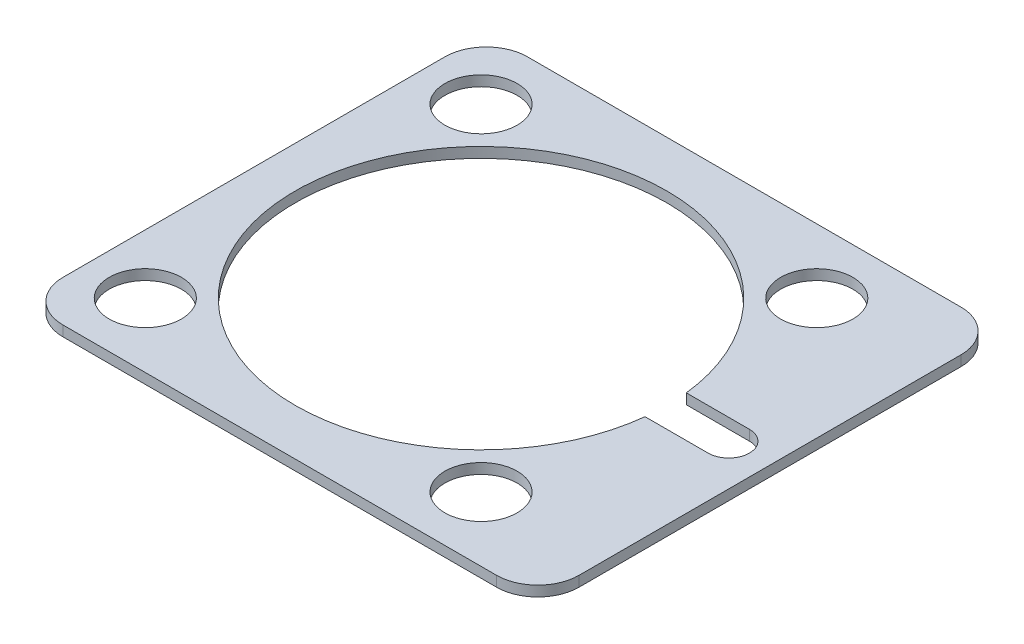
ISO-10303-21;
HEADER;
FILE_DESCRIPTION(('STEP AP214'),'2;1');
FILE_NAME('part.step','',(''),(''),'','','');
FILE_SCHEMA(('AUTOMOTIVE_DESIGN { 1 0 10303 214 1 1 1 1 }'));
ENDSEC;
DATA;
#1=APPLICATION_CONTEXT('core data for automotive mechanical design processes');
#2=APPLICATION_PROTOCOL_DEFINITION('international standard','automotive_design',2000,#1);
#3=PRODUCT_CONTEXT('',#1,'mechanical');
#4=PRODUCT('Part','Part','',(#3));
#5=PRODUCT_RELATED_PRODUCT_CATEGORY('part','',(#4));
#6=PRODUCT_DEFINITION_FORMATION('','',#4);
#7=PRODUCT_DEFINITION_CONTEXT('part definition',#1,'design');
#8=PRODUCT_DEFINITION('design','',#6,#7);
#9=PRODUCT_DEFINITION_SHAPE('','',#8);
#10=(LENGTH_UNIT() NAMED_UNIT(*) SI_UNIT(.MILLI.,.METRE.));
#11=(NAMED_UNIT(*) PLANE_ANGLE_UNIT() SI_UNIT($,.RADIAN.));
#12=(NAMED_UNIT(*) SI_UNIT($,.STERADIAN.) SOLID_ANGLE_UNIT());
#13=UNCERTAINTY_MEASURE_WITH_UNIT(LENGTH_MEASURE(1.E-05),#10,'distance_accuracy_value','');
#14=(GEOMETRIC_REPRESENTATION_CONTEXT(3) GLOBAL_UNCERTAINTY_ASSIGNED_CONTEXT((#13)) GLOBAL_UNIT_ASSIGNED_CONTEXT((#10,
#11,#12)) REPRESENTATION_CONTEXT('',''));
#15=CARTESIAN_POINT('',(0.,0.,0.));
#16=DIRECTION('',(0.,0.,1.));
#17=DIRECTION('',(1.,0.,0.));
#18=AXIS2_PLACEMENT_3D('',#15,#16,#17);
#19=CARTESIAN_POINT('',(-22.,0.5,22.5));
#20=DIRECTION('',(1.,0.,0.));
#21=DIRECTION('',(0.,0.,-1.));
#22=AXIS2_PLACEMENT_3D('',#19,#20,#21);
#23=PLANE('',#22);
#24=DIRECTION('',(0.,0.,1.));
#25=VECTOR('',#24,1.);
#26=CARTESIAN_POINT('',(-22.,0.5,22.5));
#27=LINE('',#26,#25);
#28=CARTESIAN_POINT('',(-22.,0.5,-18.5));
#29=VERTEX_POINT('',#28);
#30=CARTESIAN_POINT('',(-22.,0.5,18.5));
#31=VERTEX_POINT('',#30);
#32=EDGE_CURVE('E198',#29,#31,#27,.T.);
#33=ORIENTED_EDGE('',*,*,#32,.F.);
#34=DIRECTION('',(0.,-1.,0.));
#35=VECTOR('',#34,1.);
#36=CARTESIAN_POINT('',(-22.,0.5,-18.5));
#37=LINE('',#36,#35);
#38=CARTESIAN_POINT('',(-22.,-0.5,-18.5));
#39=VERTEX_POINT('',#38);
#40=EDGE_CURVE('E229',#29,#39,#37,.T.);
#41=ORIENTED_EDGE('',*,*,#40,.T.);
#42=DIRECTION('',(0.,0.,1.));
#43=VECTOR('',#42,1.);
#44=CARTESIAN_POINT('',(-22.,-0.5,22.5));
#45=LINE('',#44,#43);
#46=CARTESIAN_POINT('',(-22.,-0.5,18.5));
#47=VERTEX_POINT('',#46);
#48=EDGE_CURVE('E192',#39,#47,#45,.T.);
#49=ORIENTED_EDGE('',*,*,#48,.T.);
#50=DIRECTION('',(0.,-1.,0.));
#51=VECTOR('',#50,1.);
#52=CARTESIAN_POINT('',(-22.,0.5,18.5));
#53=LINE('',#52,#51);
#54=EDGE_CURVE('E213',#47,#31,#53,.F.);
#55=ORIENTED_EDGE('',*,*,#54,.T.);
#56=EDGE_LOOP('',(#33,#41,#49,#55));
#57=FACE_BOUND('',#56,.T.);
#58=ADVANCED_FACE('F45',(#57),#23,.F.);
#59=CARTESIAN_POINT('',(28.,0.5,22.5));
#60=DIRECTION('',(0.,0.,-1.));
#61=DIRECTION('',(-1.,0.,0.));
#62=AXIS2_PLACEMENT_3D('',#59,#60,#61);
#63=PLANE('',#62);
#64=DIRECTION('',(1.,0.,0.));
#65=VECTOR('',#64,1.);
#66=CARTESIAN_POINT('',(28.,0.5,22.5));
#67=LINE('',#66,#65);
#68=CARTESIAN_POINT('',(-18.,0.5,22.5));
#69=VERTEX_POINT('',#68);
#70=CARTESIAN_POINT('',(24.,0.5,22.5));
#71=VERTEX_POINT('',#70);
#72=EDGE_CURVE('E202',#69,#71,#67,.T.);
#73=ORIENTED_EDGE('',*,*,#72,.F.);
#74=DIRECTION('',(0.,-1.,0.));
#75=VECTOR('',#74,1.);
#76=CARTESIAN_POINT('',(-18.,0.5,22.5));
#77=LINE('',#76,#75);
#78=CARTESIAN_POINT('',(-18.,-0.5,22.5));
#79=VERTEX_POINT('',#78);
#80=EDGE_CURVE('E11',#69,#79,#77,.T.);
#81=ORIENTED_EDGE('',*,*,#80,.T.);
#82=DIRECTION('',(1.,0.,0.));
#83=VECTOR('',#82,1.);
#84=CARTESIAN_POINT('',(28.,-0.5,22.5));
#85=LINE('',#84,#83);
#86=CARTESIAN_POINT('',(24.,-0.5,22.5));
#87=VERTEX_POINT('',#86);
#88=EDGE_CURVE('E217',#79,#87,#85,.T.);
#89=ORIENTED_EDGE('',*,*,#88,.T.);
#90=DIRECTION('',(0.,-1.,0.));
#91=VECTOR('',#90,1.);
#92=CARTESIAN_POINT('',(24.,0.5,22.5));
#93=LINE('',#92,#91);
#94=EDGE_CURVE('E54',#87,#71,#93,.F.);
#95=ORIENTED_EDGE('',*,*,#94,.T.);
#96=EDGE_LOOP('',(#73,#81,#89,#95));
#97=FACE_BOUND('',#96,.T.);
#98=ADVANCED_FACE('F273',(#97),#63,.F.);
#99=CARTESIAN_POINT('',(28.,0.5,22.5));
#100=DIRECTION('',(-1.,0.,0.));
#101=DIRECTION('',(0.,0.,1.));
#102=AXIS2_PLACEMENT_3D('',#99,#100,#101);
#103=PLANE('',#102);
#104=DIRECTION('',(0.,0.,-1.));
#105=VECTOR('',#104,1.);
#106=CARTESIAN_POINT('',(28.,-0.5,22.5));
#107=LINE('',#106,#105);
#108=CARTESIAN_POINT('',(28.,-0.5,18.5));
#109=VERTEX_POINT('',#108);
#110=CARTESIAN_POINT('',(28.,-0.5,-18.5));
#111=VERTEX_POINT('',#110);
#112=EDGE_CURVE('E221',#109,#111,#107,.T.);
#113=ORIENTED_EDGE('',*,*,#112,.T.);
#114=DIRECTION('',(0.,-1.,0.));
#115=VECTOR('',#114,1.);
#116=CARTESIAN_POINT('',(28.,0.5,-18.5));
#117=LINE('',#116,#115);
#118=CARTESIAN_POINT('',(28.,0.5,-18.5));
#119=VERTEX_POINT('',#118);
#120=EDGE_CURVE('E61',#111,#119,#117,.F.);
#121=ORIENTED_EDGE('',*,*,#120,.T.);
#122=DIRECTION('',(0.,0.,-1.));
#123=VECTOR('',#122,1.);
#124=CARTESIAN_POINT('',(28.,0.5,22.5));
#125=LINE('',#124,#123);
#126=CARTESIAN_POINT('',(28.,0.5,18.5));
#127=VERTEX_POINT('',#126);
#128=EDGE_CURVE('E206',#127,#119,#125,.T.);
#129=ORIENTED_EDGE('',*,*,#128,.F.);
#130=DIRECTION('',(0.,-1.,0.));
#131=VECTOR('',#130,1.);
#132=CARTESIAN_POINT('',(28.,0.5,18.5));
#133=LINE('',#132,#131);
#134=EDGE_CURVE('E263',#127,#109,#133,.T.);
#135=ORIENTED_EDGE('',*,*,#134,.T.);
#136=EDGE_LOOP('',(#113,#121,#129,#135));
#137=FACE_BOUND('',#136,.T.);
#138=ADVANCED_FACE('F281',(#137),#103,.F.);
#139=CARTESIAN_POINT('',(28.,0.5,-22.5));
#140=DIRECTION('',(0.,0.,1.));
#141=DIRECTION('',(1.,0.,0.));
#142=AXIS2_PLACEMENT_3D('',#139,#140,#141);
#143=PLANE('',#142);
#144=DIRECTION('',(-1.,0.,0.));
#145=VECTOR('',#144,1.);
#146=CARTESIAN_POINT('',(28.,-0.5,-22.5));
#147=LINE('',#146,#145);
#148=CARTESIAN_POINT('',(24.,-0.5,-22.5));
#149=VERTEX_POINT('',#148);
#150=CARTESIAN_POINT('',(-18.,-0.5,-22.5));
#151=VERTEX_POINT('',#150);
#152=EDGE_CURVE('E203',#149,#151,#147,.T.);
#153=ORIENTED_EDGE('',*,*,#152,.T.);
#154=DIRECTION('',(0.,-1.,0.));
#155=VECTOR('',#154,1.);
#156=CARTESIAN_POINT('',(-18.,0.5,-22.5));
#157=LINE('',#156,#155);
#158=CARTESIAN_POINT('',(-18.,0.5,-22.5));
#159=VERTEX_POINT('',#158);
#160=EDGE_CURVE('E249',#151,#159,#157,.F.);
#161=ORIENTED_EDGE('',*,*,#160,.T.);
#162=DIRECTION('',(-1.,0.,0.));
#163=VECTOR('',#162,1.);
#164=CARTESIAN_POINT('',(28.,0.5,-22.5));
#165=LINE('',#164,#163);
#166=CARTESIAN_POINT('',(24.,0.5,-22.5));
#167=VERTEX_POINT('',#166);
#168=EDGE_CURVE('E209',#167,#159,#165,.T.);
#169=ORIENTED_EDGE('',*,*,#168,.F.);
#170=DIRECTION('',(0.,-1.,0.));
#171=VECTOR('',#170,1.);
#172=CARTESIAN_POINT('',(24.,0.5,-22.5));
#173=LINE('',#172,#171);
#174=EDGE_CURVE('E245',#167,#149,#173,.T.);
#175=ORIENTED_EDGE('',*,*,#174,.T.);
#176=EDGE_LOOP('',(#153,#161,#169,#175));
#177=FACE_BOUND('',#176,.T.);
#178=ADVANCED_FACE('F290',(#177),#143,.F.);
#179=CARTESIAN_POINT('',(0.,0.5,0.));
#180=DIRECTION('',(0.,1.,0.));
#181=DIRECTION('',(0.,0.,1.));
#182=AXIS2_PLACEMENT_3D('',#179,#180,#181);
#183=PLANE('',#182);
#184=CARTESIAN_POINT('',(-16.2634559672906,0.5,-16.2634559672906));
#185=DIRECTION('',(0.,1.,0.));
#186=DIRECTION('',(1.,0.,0.));
#187=AXIS2_PLACEMENT_3D('',#184,#185,#186);
#188=CIRCLE('',#187,3.5);
#189=CARTESIAN_POINT('',(-12.7634559672906,0.5,-16.2634559672906));
#190=VERTEX_POINT('',#189);
#191=EDGE_CURVE('E489',#190,#190,#188,.T.);
#192=ORIENTED_EDGE('',*,*,#191,.F.);
#193=EDGE_LOOP('',(#192));
#194=FACE_BOUND('',#193,.T.);
#195=CARTESIAN_POINT('',(-16.2634559672906,0.5,16.2634559672906));
#196=DIRECTION('',(0.,1.,0.));
#197=DIRECTION('',(0.,0.,-1.));
#198=AXIS2_PLACEMENT_3D('',#195,#196,#197);
#199=CIRCLE('',#198,3.5);
#200=CARTESIAN_POINT('',(-16.2634559672906,0.5,12.7634559672906));
#201=VERTEX_POINT('',#200);
#202=EDGE_CURVE('E483',#201,#201,#199,.T.);
#203=ORIENTED_EDGE('',*,*,#202,.F.);
#204=EDGE_LOOP('',(#203));
#205=FACE_BOUND('',#204,.T.);
#206=CARTESIAN_POINT('',(16.2634559672907,0.5,16.2634559672904));
#207=DIRECTION('',(0.,1.,0.));
#208=DIRECTION('',(-1.,0.,0.));
#209=AXIS2_PLACEMENT_3D('',#206,#207,#208);
#210=CIRCLE('',#209,3.5);
#211=CARTESIAN_POINT('',(12.7634559672907,0.5,16.2634559672905));
#212=VERTEX_POINT('',#211);
#213=EDGE_CURVE('E477',#212,#212,#210,.T.);
#214=ORIENTED_EDGE('',*,*,#213,.F.);
#215=EDGE_LOOP('',(#214));
#216=FACE_BOUND('',#215,.T.);
#217=CARTESIAN_POINT('',(16.2634559672906,0.5,-16.2634559672906));
#218=DIRECTION('',(0.,1.,0.));
#219=DIRECTION('',(0.,0.,1.));
#220=AXIS2_PLACEMENT_3D('',#217,#218,#219);
#221=CIRCLE('',#220,3.5);
#222=CARTESIAN_POINT('',(16.2634559672906,0.5,-12.7634559672906));
#223=VERTEX_POINT('',#222);
#224=EDGE_CURVE('E173',#223,#223,#221,.T.);
#225=ORIENTED_EDGE('',*,*,#224,.F.);
#226=EDGE_LOOP('',(#225));
#227=FACE_BOUND('',#226,.T.);
#228=CARTESIAN_POINT('',(0.,0.5,0.));
#229=DIRECTION('',(0.,1.,0.));
#230=DIRECTION('',(0.,0.,1.));
#231=AXIS2_PLACEMENT_3D('',#228,#229,#230);
#232=CIRCLE('',#231,18.);
#233=CARTESIAN_POINT('',(17.8885438199983,0.5,-2.));
#234=VERTEX_POINT('',#233);
#235=CARTESIAN_POINT('',(17.8885438199983,0.5,2.));
#236=VERTEX_POINT('',#235);
#237=EDGE_CURVE('E144',#234,#236,#232,.T.);
#238=ORIENTED_EDGE('',*,*,#237,.F.);
#239=DIRECTION('',(-1.,0.,0.));
#240=VECTOR('',#239,1.);
#241=CARTESIAN_POINT('',(17.8885438199983,0.5,-2.));
#242=LINE('',#241,#240);
#243=CARTESIAN_POINT('',(24.,0.5,-2.));
#244=VERTEX_POINT('',#243);
#245=EDGE_CURVE('E165',#244,#234,#242,.T.);
#246=ORIENTED_EDGE('',*,*,#245,.F.);
#247=CARTESIAN_POINT('',(24.,0.5,0.));
#248=DIRECTION('',(0.,1.,0.));
#249=DIRECTION('',(0.,0.,1.));
#250=AXIS2_PLACEMENT_3D('',#247,#248,#249);
#251=CIRCLE('',#250,2.);
#252=CARTESIAN_POINT('',(24.,0.5,2.));
#253=VERTEX_POINT('',#252);
#254=EDGE_CURVE('E170',#253,#244,#251,.T.);
#255=ORIENTED_EDGE('',*,*,#254,.F.);
#256=DIRECTION('',(1.,0.,0.));
#257=VECTOR('',#256,1.);
#258=CARTESIAN_POINT('',(17.8885438199983,0.5,2.));
#259=LINE('',#258,#257);
#260=EDGE_CURVE('E182',#236,#253,#259,.T.);
#261=ORIENTED_EDGE('',*,*,#260,.F.);
#262=EDGE_LOOP('',(#238,#246,#255,#261));
#263=FACE_BOUND('',#262,.T.);
#264=ORIENTED_EDGE('',*,*,#168,.T.);
#265=CARTESIAN_POINT('',(-18.,0.5,-18.5));
#266=DIRECTION('',(0.,1.,0.));
#267=DIRECTION('',(0.,0.,1.));
#268=AXIS2_PLACEMENT_3D('',#265,#266,#267);
#269=CIRCLE('',#268,4.);
#270=EDGE_CURVE('E260',#159,#29,#269,.T.);
#271=ORIENTED_EDGE('',*,*,#270,.T.);
#272=ORIENTED_EDGE('',*,*,#32,.T.);
#273=CARTESIAN_POINT('',(-18.,0.5,18.5));
#274=DIRECTION('',(0.,1.,0.));
#275=DIRECTION('',(0.,0.,1.));
#276=AXIS2_PLACEMENT_3D('',#273,#274,#275);
#277=CIRCLE('',#276,4.);
#278=EDGE_CURVE('E254',#31,#69,#277,.T.);
#279=ORIENTED_EDGE('',*,*,#278,.T.);
#280=ORIENTED_EDGE('',*,*,#72,.T.);
#281=CARTESIAN_POINT('',(24.,0.5,18.5));
#282=DIRECTION('',(0.,1.,0.));
#283=DIRECTION('',(0.,0.,1.));
#284=AXIS2_PLACEMENT_3D('',#281,#282,#283);
#285=CIRCLE('',#284,4.);
#286=EDGE_CURVE('E68',#71,#127,#285,.T.);
#287=ORIENTED_EDGE('',*,*,#286,.T.);
#288=ORIENTED_EDGE('',*,*,#128,.T.);
#289=CARTESIAN_POINT('',(24.,0.5,-18.5));
#290=DIRECTION('',(0.,1.,0.));
#291=DIRECTION('',(0.,0.,1.));
#292=AXIS2_PLACEMENT_3D('',#289,#290,#291);
#293=CIRCLE('',#292,4.);
#294=EDGE_CURVE('E257',#119,#167,#293,.T.);
#295=ORIENTED_EDGE('',*,*,#294,.T.);
#296=EDGE_LOOP('',(#264,#271,#272,#279,#280,#287,#288,#295));
#297=FACE_BOUND('',#296,.T.);
#298=ADVANCED_FACE('F277',(#194,#205,#216,#227,#263,#297),#183,.T.);
#299=CARTESIAN_POINT('',(0.,-0.5,0.));
#300=DIRECTION('',(0.,1.,0.));
#301=DIRECTION('',(0.,0.,1.));
#302=AXIS2_PLACEMENT_3D('',#299,#300,#301);
#303=PLANE('',#302);
#304=CARTESIAN_POINT('',(-16.2634559672906,-0.5,-16.2634559672906));
#305=DIRECTION('',(0.,1.,0.));
#306=DIRECTION('',(1.,0.,0.));
#307=AXIS2_PLACEMENT_3D('',#304,#305,#306);
#308=CIRCLE('',#307,3.5);
#309=CARTESIAN_POINT('',(-12.7634559672906,-0.5,-16.2634559672906));
#310=VERTEX_POINT('',#309);
#311=EDGE_CURVE('E461',#310,#310,#308,.T.);
#312=ORIENTED_EDGE('',*,*,#311,.T.);
#313=EDGE_LOOP('',(#312));
#314=FACE_BOUND('',#313,.T.);
#315=CARTESIAN_POINT('',(-16.2634559672906,-0.5,16.2634559672906));
#316=DIRECTION('',(0.,1.,0.));
#317=DIRECTION('',(0.,0.,-1.));
#318=AXIS2_PLACEMENT_3D('',#315,#316,#317);
#319=CIRCLE('',#318,3.5);
#320=CARTESIAN_POINT('',(-16.2634559672906,-0.5,12.7634559672906));
#321=VERTEX_POINT('',#320);
#322=EDGE_CURVE('E465',#321,#321,#319,.T.);
#323=ORIENTED_EDGE('',*,*,#322,.T.);
#324=EDGE_LOOP('',(#323));
#325=FACE_BOUND('',#324,.T.);
#326=CARTESIAN_POINT('',(16.2634559672907,-0.5,16.2634559672904));
#327=DIRECTION('',(0.,1.,0.));
#328=DIRECTION('',(-1.,0.,0.));
#329=AXIS2_PLACEMENT_3D('',#326,#327,#328);
#330=CIRCLE('',#329,3.5);
#331=CARTESIAN_POINT('',(12.7634559672907,-0.5,16.2634559672905));
#332=VERTEX_POINT('',#331);
#333=EDGE_CURVE('E469',#332,#332,#330,.T.);
#334=ORIENTED_EDGE('',*,*,#333,.T.);
#335=EDGE_LOOP('',(#334));
#336=FACE_BOUND('',#335,.T.);
#337=CARTESIAN_POINT('',(16.2634559672906,-0.5,-16.2634559672906));
#338=DIRECTION('',(0.,1.,0.));
#339=DIRECTION('',(0.,0.,1.));
#340=AXIS2_PLACEMENT_3D('',#337,#338,#339);
#341=CIRCLE('',#340,3.5);
#342=CARTESIAN_POINT('',(16.2634559672906,-0.5,-12.7634559672906));
#343=VERTEX_POINT('',#342);
#344=EDGE_CURVE('E183',#343,#343,#341,.T.);
#345=ORIENTED_EDGE('',*,*,#344,.T.);
#346=EDGE_LOOP('',(#345));
#347=FACE_BOUND('',#346,.T.);
#348=DIRECTION('',(-1.,0.,0.));
#349=VECTOR('',#348,1.);
#350=CARTESIAN_POINT('',(17.8885438199983,-0.5,-2.));
#351=LINE('',#350,#349);
#352=CARTESIAN_POINT('',(24.,-0.5,-2.));
#353=VERTEX_POINT('',#352);
#354=CARTESIAN_POINT('',(17.8885438199983,-0.5,-2.));
#355=VERTEX_POINT('',#354);
#356=EDGE_CURVE('E150',#353,#355,#351,.T.);
#357=ORIENTED_EDGE('',*,*,#356,.T.);
#358=CARTESIAN_POINT('',(0.,-0.5,0.));
#359=DIRECTION('',(0.,1.,0.));
#360=DIRECTION('',(0.,0.,1.));
#361=AXIS2_PLACEMENT_3D('',#358,#359,#360);
#362=CIRCLE('',#361,18.);
#363=CARTESIAN_POINT('',(17.8885438199983,-0.5,2.));
#364=VERTEX_POINT('',#363);
#365=EDGE_CURVE('E141',#355,#364,#362,.T.);
#366=ORIENTED_EDGE('',*,*,#365,.T.);
#367=DIRECTION('',(1.,0.,0.));
#368=VECTOR('',#367,1.);
#369=CARTESIAN_POINT('',(17.8885438199983,-0.5,2.));
#370=LINE('',#369,#368);
#371=CARTESIAN_POINT('',(24.,-0.5,2.));
#372=VERTEX_POINT('',#371);
#373=EDGE_CURVE('E154',#364,#372,#370,.T.);
#374=ORIENTED_EDGE('',*,*,#373,.T.);
#375=CARTESIAN_POINT('',(24.,-0.5,0.));
#376=DIRECTION('',(0.,1.,0.));
#377=DIRECTION('',(0.,0.,1.));
#378=AXIS2_PLACEMENT_3D('',#375,#376,#377);
#379=CIRCLE('',#378,2.);
#380=EDGE_CURVE('E159',#372,#353,#379,.T.);
#381=ORIENTED_EDGE('',*,*,#380,.T.);
#382=EDGE_LOOP('',(#357,#366,#374,#381));
#383=FACE_BOUND('',#382,.T.);
#384=ORIENTED_EDGE('',*,*,#48,.F.);
#385=CARTESIAN_POINT('',(-18.,-0.5,-18.5));
#386=DIRECTION('',(0.,1.,0.));
#387=DIRECTION('',(0.,0.,1.));
#388=AXIS2_PLACEMENT_3D('',#385,#386,#387);
#389=CIRCLE('',#388,4.);
#390=EDGE_CURVE('E242',#39,#151,#389,.F.);
#391=ORIENTED_EDGE('',*,*,#390,.T.);
#392=ORIENTED_EDGE('',*,*,#152,.F.);
#393=CARTESIAN_POINT('',(24.,-0.5,-18.5));
#394=DIRECTION('',(0.,1.,0.));
#395=DIRECTION('',(0.,0.,1.));
#396=AXIS2_PLACEMENT_3D('',#393,#394,#395);
#397=CIRCLE('',#396,4.);
#398=EDGE_CURVE('E239',#149,#111,#397,.F.);
#399=ORIENTED_EDGE('',*,*,#398,.T.);
#400=ORIENTED_EDGE('',*,*,#112,.F.);
#401=CARTESIAN_POINT('',(24.,-0.5,18.5));
#402=DIRECTION('',(0.,1.,0.));
#403=DIRECTION('',(0.,0.,1.));
#404=AXIS2_PLACEMENT_3D('',#401,#402,#403);
#405=CIRCLE('',#404,4.);
#406=EDGE_CURVE('E233',#109,#87,#405,.F.);
#407=ORIENTED_EDGE('',*,*,#406,.T.);
#408=ORIENTED_EDGE('',*,*,#88,.F.);
#409=CARTESIAN_POINT('',(-18.,-0.5,18.5));
#410=DIRECTION('',(0.,1.,0.));
#411=DIRECTION('',(0.,0.,1.));
#412=AXIS2_PLACEMENT_3D('',#409,#410,#411);
#413=CIRCLE('',#412,4.);
#414=EDGE_CURVE('E236',#79,#47,#413,.F.);
#415=ORIENTED_EDGE('',*,*,#414,.T.);
#416=EDGE_LOOP('',(#384,#391,#392,#399,#400,#407,#408,#415));
#417=FACE_BOUND('',#416,.T.);
#418=ADVANCED_FACE('F161',(#314,#325,#336,#347,#383,#417),#303,.F.);
#419=CARTESIAN_POINT('',(0.,-0.5,0.));
#420=DIRECTION('',(0.,1.,0.));
#421=DIRECTION('',(0.,0.,1.));
#422=AXIS2_PLACEMENT_3D('',#419,#420,#421);
#423=CYLINDRICAL_SURFACE('',#422,18.);
#424=ORIENTED_EDGE('',*,*,#237,.T.);
#425=DIRECTION('',(0.,1.,0.));
#426=VECTOR('',#425,1.);
#427=CARTESIAN_POINT('',(17.8885438199983,-0.5,2.));
#428=LINE('',#427,#426);
#429=EDGE_CURVE('E137',#364,#236,#428,.T.);
#430=ORIENTED_EDGE('',*,*,#429,.F.);
#431=ORIENTED_EDGE('',*,*,#365,.F.);
#432=DIRECTION('',(0.,1.,0.));
#433=VECTOR('',#432,1.);
#434=CARTESIAN_POINT('',(17.8885438199983,-0.5,-2.));
#435=LINE('',#434,#433);
#436=EDGE_CURVE('E189',#355,#234,#435,.T.);
#437=ORIENTED_EDGE('',*,*,#436,.T.);
#438=EDGE_LOOP('',(#424,#430,#431,#437));
#439=FACE_BOUND('',#438,.T.);
#440=ADVANCED_FACE('F139',(#439),#423,.F.);
#441=CARTESIAN_POINT('',(17.8885438199983,-0.5,-2.));
#442=DIRECTION('',(0.,0.,-1.));
#443=DIRECTION('',(-1.,0.,0.));
#444=AXIS2_PLACEMENT_3D('',#441,#442,#443);
#445=PLANE('',#444);
#446=ORIENTED_EDGE('',*,*,#245,.T.);
#447=ORIENTED_EDGE('',*,*,#436,.F.);
#448=ORIENTED_EDGE('',*,*,#356,.F.);
#449=DIRECTION('',(0.,1.,0.));
#450=VECTOR('',#449,1.);
#451=CARTESIAN_POINT('',(24.,-0.5,-2.));
#452=LINE('',#451,#450);
#453=EDGE_CURVE('E193',#353,#244,#452,.T.);
#454=ORIENTED_EDGE('',*,*,#453,.T.);
#455=EDGE_LOOP('',(#446,#447,#448,#454));
#456=FACE_BOUND('',#455,.T.);
#457=ADVANCED_FACE('F340',(#456),#445,.F.);
#458=CARTESIAN_POINT('',(24.,-0.5,0.));
#459=DIRECTION('',(0.,1.,0.));
#460=DIRECTION('',(0.,0.,1.));
#461=AXIS2_PLACEMENT_3D('',#458,#459,#460);
#462=CYLINDRICAL_SURFACE('',#461,2.);
#463=ORIENTED_EDGE('',*,*,#254,.T.);
#464=ORIENTED_EDGE('',*,*,#453,.F.);
#465=ORIENTED_EDGE('',*,*,#380,.F.);
#466=DIRECTION('',(0.,1.,0.));
#467=VECTOR('',#466,1.);
#468=CARTESIAN_POINT('',(24.,-0.5,2.));
#469=LINE('',#468,#467);
#470=EDGE_CURVE('E149',#372,#253,#469,.T.);
#471=ORIENTED_EDGE('',*,*,#470,.T.);
#472=EDGE_LOOP('',(#463,#464,#465,#471));
#473=FACE_BOUND('',#472,.T.);
#474=ADVANCED_FACE('F343',(#473),#462,.F.);
#475=CARTESIAN_POINT('',(17.8885438199983,-0.5,2.));
#476=DIRECTION('',(0.,0.,1.));
#477=DIRECTION('',(1.,0.,0.));
#478=AXIS2_PLACEMENT_3D('',#475,#476,#477);
#479=PLANE('',#478);
#480=ORIENTED_EDGE('',*,*,#260,.T.);
#481=ORIENTED_EDGE('',*,*,#470,.F.);
#482=ORIENTED_EDGE('',*,*,#373,.F.);
#483=ORIENTED_EDGE('',*,*,#429,.T.);
#484=EDGE_LOOP('',(#480,#481,#482,#483));
#485=FACE_BOUND('',#484,.T.);
#486=ADVANCED_FACE('F155',(#485),#479,.F.);
#487=CARTESIAN_POINT('',(16.2634559672906,-0.5,-16.2634559672906));
#488=DIRECTION('',(0.,1.,0.));
#489=DIRECTION('',(0.,0.,1.));
#490=AXIS2_PLACEMENT_3D('',#487,#488,#489);
#491=CYLINDRICAL_SURFACE('',#490,3.5);
#492=ORIENTED_EDGE('',*,*,#344,.F.);
#493=EDGE_LOOP('',(#492));
#494=FACE_BOUND('',#493,.T.);
#495=ORIENTED_EDGE('',*,*,#224,.T.);
#496=EDGE_LOOP('',(#495));
#497=FACE_BOUND('',#496,.T.);
#498=ADVANCED_FACE('F335',(#494,#497),#491,.F.);
#499=CARTESIAN_POINT('',(16.2634559672907,-0.5,16.2634559672904));
#500=DIRECTION('',(0.,1.,0.));
#501=DIRECTION('',(0.,0.,1.));
#502=AXIS2_PLACEMENT_3D('',#499,#500,#501);
#503=CYLINDRICAL_SURFACE('',#502,3.5);
#504=ORIENTED_EDGE('',*,*,#333,.F.);
#505=EDGE_LOOP('',(#504));
#506=FACE_BOUND('',#505,.T.);
#507=ORIENTED_EDGE('',*,*,#213,.T.);
#508=EDGE_LOOP('',(#507));
#509=FACE_BOUND('',#508,.T.);
#510=ADVANCED_FACE('F327',(#506,#509),#503,.F.);
#511=CARTESIAN_POINT('',(-16.2634559672906,-0.5,16.2634559672906));
#512=DIRECTION('',(0.,1.,0.));
#513=DIRECTION('',(0.,0.,1.));
#514=AXIS2_PLACEMENT_3D('',#511,#512,#513);
#515=CYLINDRICAL_SURFACE('',#514,3.5);
#516=ORIENTED_EDGE('',*,*,#322,.F.);
#517=EDGE_LOOP('',(#516));
#518=FACE_BOUND('',#517,.T.);
#519=ORIENTED_EDGE('',*,*,#202,.T.);
#520=EDGE_LOOP('',(#519));
#521=FACE_BOUND('',#520,.T.);
#522=ADVANCED_FACE('F321',(#518,#521),#515,.F.);
#523=CARTESIAN_POINT('',(-16.2634559672906,-0.5,-16.2634559672906));
#524=DIRECTION('',(0.,1.,0.));
#525=DIRECTION('',(0.,0.,1.));
#526=AXIS2_PLACEMENT_3D('',#523,#524,#525);
#527=CYLINDRICAL_SURFACE('',#526,3.5);
#528=ORIENTED_EDGE('',*,*,#311,.F.);
#529=EDGE_LOOP('',(#528));
#530=FACE_BOUND('',#529,.T.);
#531=ORIENTED_EDGE('',*,*,#191,.T.);
#532=EDGE_LOOP('',(#531));
#533=FACE_BOUND('',#532,.T.);
#534=ADVANCED_FACE('F317',(#530,#533),#527,.F.);
#535=CARTESIAN_POINT('',(-18.,0.5,-18.5));
#536=DIRECTION('',(0.,-1.,0.));
#537=DIRECTION('',(0.,0.,-1.));
#538=AXIS2_PLACEMENT_3D('',#535,#536,#537);
#539=CYLINDRICAL_SURFACE('',#538,4.);
#540=ORIENTED_EDGE('',*,*,#270,.F.);
#541=ORIENTED_EDGE('',*,*,#160,.F.);
#542=ORIENTED_EDGE('',*,*,#390,.F.);
#543=ORIENTED_EDGE('',*,*,#40,.F.);
#544=EDGE_LOOP('',(#540,#541,#542,#543));
#545=FACE_BOUND('',#544,.T.);
#546=ADVANCED_FACE('F296',(#545),#539,.T.);
#547=CARTESIAN_POINT('',(24.,0.5,-18.5));
#548=DIRECTION('',(0.,-1.,0.));
#549=DIRECTION('',(0.,0.,-1.));
#550=AXIS2_PLACEMENT_3D('',#547,#548,#549);
#551=CYLINDRICAL_SURFACE('',#550,4.);
#552=ORIENTED_EDGE('',*,*,#294,.F.);
#553=ORIENTED_EDGE('',*,*,#120,.F.);
#554=ORIENTED_EDGE('',*,*,#398,.F.);
#555=ORIENTED_EDGE('',*,*,#174,.F.);
#556=EDGE_LOOP('',(#552,#553,#554,#555));
#557=FACE_BOUND('',#556,.T.);
#558=ADVANCED_FACE('F287',(#557),#551,.T.);
#559=CARTESIAN_POINT('',(-18.,0.5,18.5));
#560=DIRECTION('',(0.,-1.,0.));
#561=DIRECTION('',(0.,0.,-1.));
#562=AXIS2_PLACEMENT_3D('',#559,#560,#561);
#563=CYLINDRICAL_SURFACE('',#562,4.);
#564=ORIENTED_EDGE('',*,*,#278,.F.);
#565=ORIENTED_EDGE('',*,*,#54,.F.);
#566=ORIENTED_EDGE('',*,*,#414,.F.);
#567=ORIENTED_EDGE('',*,*,#80,.F.);
#568=EDGE_LOOP('',(#564,#565,#566,#567));
#569=FACE_BOUND('',#568,.T.);
#570=ADVANCED_FACE('F300',(#569),#563,.T.);
#571=CARTESIAN_POINT('',(24.,0.5,18.5));
#572=DIRECTION('',(0.,-1.,0.));
#573=DIRECTION('',(0.,0.,-1.));
#574=AXIS2_PLACEMENT_3D('',#571,#572,#573);
#575=CYLINDRICAL_SURFACE('',#574,4.);
#576=ORIENTED_EDGE('',*,*,#286,.F.);
#577=ORIENTED_EDGE('',*,*,#94,.F.);
#578=ORIENTED_EDGE('',*,*,#406,.F.);
#579=ORIENTED_EDGE('',*,*,#134,.F.);
#580=EDGE_LOOP('',(#576,#577,#578,#579));
#581=FACE_BOUND('',#580,.T.);
#582=ADVANCED_FACE('F47',(#581),#575,.T.);
#583=CLOSED_SHELL('',(#58,#98,#138,#178,#298,#418,#440,#457,#474,#486,#498,#510,#522,#534,#546,
#558,#570,#582));
#584=MANIFOLD_SOLID_BREP('B2',#583);
#585=ADVANCED_BREP_SHAPE_REPRESENTATION('',(#18,#584),#14);
#586=SHAPE_DEFINITION_REPRESENTATION(#9,#585);
ENDSEC;
END-ISO-10303-21;
